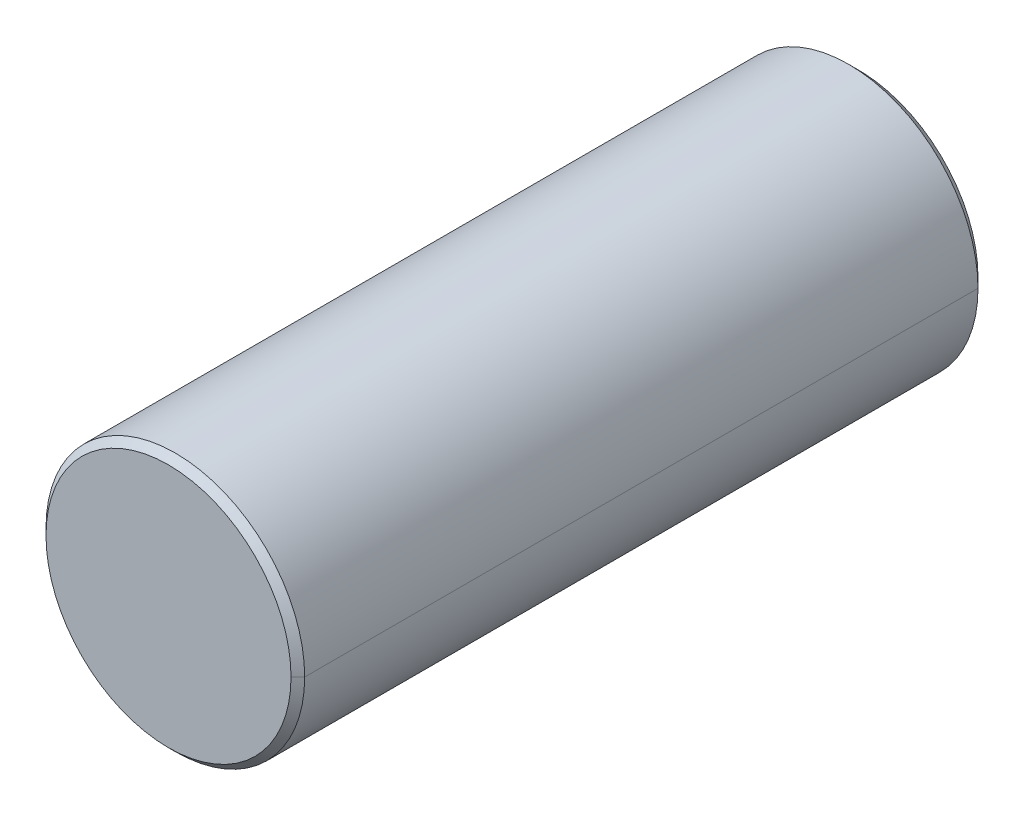
ISO-10303-21;
HEADER;
FILE_DESCRIPTION(('STEP AP214'),'2;1');
FILE_NAME('part.step','',(''),(''),'','','');
FILE_SCHEMA(('AUTOMOTIVE_DESIGN { 1 0 10303 214 1 1 1 1 }'));
ENDSEC;
DATA;
#1=APPLICATION_CONTEXT('core data for automotive mechanical design processes');
#2=APPLICATION_PROTOCOL_DEFINITION('international standard','automotive_design',2000,#1);
#3=PRODUCT_CONTEXT('',#1,'mechanical');
#4=PRODUCT('Part','Part','',(#3));
#5=PRODUCT_RELATED_PRODUCT_CATEGORY('part','',(#4));
#6=PRODUCT_DEFINITION_FORMATION('','',#4);
#7=PRODUCT_DEFINITION_CONTEXT('part definition',#1,'design');
#8=PRODUCT_DEFINITION('design','',#6,#7);
#9=PRODUCT_DEFINITION_SHAPE('','',#8);
#10=(LENGTH_UNIT() NAMED_UNIT(*) SI_UNIT(.MILLI.,.METRE.));
#11=(NAMED_UNIT(*) PLANE_ANGLE_UNIT() SI_UNIT($,.RADIAN.));
#12=(NAMED_UNIT(*) SI_UNIT($,.STERADIAN.) SOLID_ANGLE_UNIT());
#13=UNCERTAINTY_MEASURE_WITH_UNIT(LENGTH_MEASURE(1.E-05),#10,'distance_accuracy_value','');
#14=(GEOMETRIC_REPRESENTATION_CONTEXT(3) GLOBAL_UNCERTAINTY_ASSIGNED_CONTEXT((#13)) GLOBAL_UNIT_ASSIGNED_CONTEXT((#10,
#11,#12)) REPRESENTATION_CONTEXT('',''));
#15=CARTESIAN_POINT('',(0.,0.,0.));
#16=DIRECTION('',(0.,0.,1.));
#17=DIRECTION('',(1.,0.,0.));
#18=AXIS2_PLACEMENT_3D('',#15,#16,#17);
#19=CARTESIAN_POINT('',(0.,0.,-12.3444));
#20=DIRECTION('',(0.,0.,1.));
#21=DIRECTION('',(0.,-1.,0.));
#22=AXIS2_PLACEMENT_3D('',#19,#20,#21);
#23=CONICAL_SURFACE('',#22,4.7625,0.7853981634);
#24=CARTESIAN_POINT('',(0.,0.,-12.7));
#25=DIRECTION('',(0.,0.,-1.));
#26=DIRECTION('',(-1.,0.,0.));
#27=AXIS2_PLACEMENT_3D('',#24,#25,#26);
#28=CIRCLE('',#27,4.4069);
#29=CARTESIAN_POINT('',(-4.4069,0.,-12.7));
#30=VERTEX_POINT('',#29);
#31=CARTESIAN_POINT('',(4.40689999999909,0.,-12.6999999999991));
#32=VERTEX_POINT('',#31);
#33=EDGE_CURVE('E11',#30,#32,#28,.T.);
#34=ORIENTED_EDGE('',*,*,#33,.F.);
#35=DIRECTION('',(-0.707106781188351,0.,0.707106781184744));
#36=VECTOR('',#35,1.);
#37=CARTESIAN_POINT('',(-4.40689999999909,0.,-12.6999999999991));
#38=LINE('',#37,#36);
#39=CARTESIAN_POINT('',(-4.7625,0.,-12.3444));
#40=VERTEX_POINT('',#39);
#41=EDGE_CURVE('E25',#30,#40,#38,.T.);
#42=ORIENTED_EDGE('',*,*,#41,.T.);
#43=CARTESIAN_POINT('',(0.,0.,-12.3444));
#44=DIRECTION('',(0.,0.,-1.));
#45=DIRECTION('',(-1.,0.,0.));
#46=AXIS2_PLACEMENT_3D('',#43,#44,#45);
#47=CIRCLE('',#46,4.7625);
#48=CARTESIAN_POINT('',(4.7625,0.,-12.3444));
#49=VERTEX_POINT('',#48);
#50=EDGE_CURVE('E111',#40,#49,#47,.T.);
#51=ORIENTED_EDGE('',*,*,#50,.T.);
#52=DIRECTION('',(0.707106781188351,0.,0.707106781184744));
#53=VECTOR('',#52,1.);
#54=CARTESIAN_POINT('',(4.40689999999909,0.,-12.6999999999991));
#55=LINE('',#54,#53);
#56=EDGE_CURVE('E106',#32,#49,#55,.T.);
#57=ORIENTED_EDGE('',*,*,#56,.F.);
#58=EDGE_LOOP('',(#34,#42,#51,#57));
#59=FACE_BOUND('',#58,.T.);
#60=ADVANCED_FACE('F17',(#59),#23,.T.);
#61=CARTESIAN_POINT('',(0.,0.,-12.3444));
#62=DIRECTION('',(0.,0.,1.));
#63=DIRECTION('',(0.,1.,0.));
#64=AXIS2_PLACEMENT_3D('',#61,#62,#63);
#65=CONICAL_SURFACE('',#64,4.7625,0.7853981634);
#66=CARTESIAN_POINT('',(0.,0.,-12.3444));
#67=DIRECTION('',(0.,0.,-1.));
#68=DIRECTION('',(-1.,0.,0.));
#69=AXIS2_PLACEMENT_3D('',#66,#67,#68);
#70=CIRCLE('',#69,4.7625);
#71=EDGE_CURVE('E102',#49,#40,#70,.T.);
#72=ORIENTED_EDGE('',*,*,#71,.T.);
#73=ORIENTED_EDGE('',*,*,#41,.F.);
#74=CARTESIAN_POINT('',(0.,0.,-12.7));
#75=DIRECTION('',(0.,0.,-1.));
#76=DIRECTION('',(-1.,0.,0.));
#77=AXIS2_PLACEMENT_3D('',#74,#75,#76);
#78=CIRCLE('',#77,4.4069);
#79=EDGE_CURVE('E97',#32,#30,#78,.T.);
#80=ORIENTED_EDGE('',*,*,#79,.F.);
#81=ORIENTED_EDGE('',*,*,#56,.T.);
#82=EDGE_LOOP('',(#72,#73,#80,#81));
#83=FACE_BOUND('',#82,.T.);
#84=ADVANCED_FACE('F125',(#83),#65,.T.);
#85=CARTESIAN_POINT('',(0.,4.4069,-12.7));
#86=DIRECTION('',(0.,0.,1.));
#87=DIRECTION('',(1.,0.,0.));
#88=AXIS2_PLACEMENT_3D('',#85,#86,#87);
#89=PLANE('',#88);
#90=ORIENTED_EDGE('',*,*,#33,.T.);
#91=ORIENTED_EDGE('',*,*,#79,.T.);
#92=EDGE_LOOP('',(#90,#91));
#93=FACE_BOUND('',#92,.T.);
#94=ADVANCED_FACE('F138',(#93),#89,.F.);
#95=CARTESIAN_POINT('',(0.,0.,-12.7));
#96=DIRECTION('',(0.,0.,1.));
#97=DIRECTION('',(0.,1.,0.));
#98=AXIS2_PLACEMENT_3D('',#95,#96,#97);
#99=CYLINDRICAL_SURFACE('',#98,4.7625);
#100=CARTESIAN_POINT('',(0.,0.,12.44855282861));
#101=DIRECTION('',(0.,0.,-1.));
#102=DIRECTION('',(-1.,0.,0.));
#103=AXIS2_PLACEMENT_3D('',#100,#101,#102);
#104=CIRCLE('',#103,4.7625);
#105=CARTESIAN_POINT('',(4.7625,0.,12.44855282861));
#106=VERTEX_POINT('',#105);
#107=CARTESIAN_POINT('',(-4.7625,0.,12.44855282861));
#108=VERTEX_POINT('',#107);
#109=EDGE_CURVE('E68',#106,#108,#104,.T.);
#110=ORIENTED_EDGE('',*,*,#109,.T.);
#111=DIRECTION('',(0.,0.,1.));
#112=VECTOR('',#111,1.);
#113=CARTESIAN_POINT('',(-4.7625,0.,-12.3444));
#114=LINE('',#113,#112);
#115=EDGE_CURVE('E89',#40,#108,#114,.T.);
#116=ORIENTED_EDGE('',*,*,#115,.F.);
#117=ORIENTED_EDGE('',*,*,#71,.F.);
#118=DIRECTION('',(0.,0.,1.));
#119=VECTOR('',#118,1.);
#120=CARTESIAN_POINT('',(4.7625,0.,-12.3444));
#121=LINE('',#120,#119);
#122=EDGE_CURVE('E85',#49,#106,#121,.T.);
#123=ORIENTED_EDGE('',*,*,#122,.T.);
#124=EDGE_LOOP('',(#110,#116,#117,#123));
#125=FACE_BOUND('',#124,.T.);
#126=ADVANCED_FACE('F128',(#125),#99,.T.);
#127=CARTESIAN_POINT('',(0.,0.,-12.7));
#128=DIRECTION('',(0.,0.,1.));
#129=DIRECTION('',(0.,-1.,0.));
#130=AXIS2_PLACEMENT_3D('',#127,#128,#129);
#131=CYLINDRICAL_SURFACE('',#130,4.7625);
#132=ORIENTED_EDGE('',*,*,#50,.F.);
#133=ORIENTED_EDGE('',*,*,#115,.T.);
#134=CARTESIAN_POINT('',(0.,0.,12.44855282861));
#135=DIRECTION('',(0.,0.,-1.));
#136=DIRECTION('',(-1.,0.,0.));
#137=AXIS2_PLACEMENT_3D('',#134,#135,#136);
#138=CIRCLE('',#137,4.7625);
#139=EDGE_CURVE('E80',#108,#106,#138,.T.);
#140=ORIENTED_EDGE('',*,*,#139,.T.);
#141=ORIENTED_EDGE('',*,*,#122,.F.);
#142=EDGE_LOOP('',(#132,#133,#140,#141));
#143=FACE_BOUND('',#142,.T.);
#144=ADVANCED_FACE('F129',(#143),#131,.T.);
#145=CARTESIAN_POINT('',(0.,0.,12.7));
#146=DIRECTION('',(0.,0.,-1.));
#147=DIRECTION('',(0.,-1.,0.));
#148=AXIS2_PLACEMENT_3D('',#145,#146,#147);
#149=CONICAL_SURFACE('',#148,4.51105282954,0.7853981634);
#150=ORIENTED_EDGE('',*,*,#139,.F.);
#151=DIRECTION('',(-0.707106781188356,0.,-0.707106781184739));
#152=VECTOR('',#151,1.);
#153=CARTESIAN_POINT('',(-4.51105282954,0.,12.7));
#154=LINE('',#153,#152);
#155=CARTESIAN_POINT('',(-4.51105282861011,0.,12.7));
#156=VERTEX_POINT('',#155);
#157=EDGE_CURVE('E60',#156,#108,#154,.T.);
#158=ORIENTED_EDGE('',*,*,#157,.F.);
#159=CARTESIAN_POINT('',(0.,0.,12.7));
#160=DIRECTION('',(0.,0.,-1.));
#161=DIRECTION('',(-1.,0.,0.));
#162=AXIS2_PLACEMENT_3D('',#159,#160,#161);
#163=CIRCLE('',#162,4.51105282954);
#164=CARTESIAN_POINT('',(4.51105282954,0.,12.7));
#165=VERTEX_POINT('',#164);
#166=EDGE_CURVE('E53',#156,#165,#163,.T.);
#167=ORIENTED_EDGE('',*,*,#166,.T.);
#168=DIRECTION('',(0.707106781188356,0.,-0.707106781184739));
#169=VECTOR('',#168,1.);
#170=CARTESIAN_POINT('',(4.51105282954,0.,12.7));
#171=LINE('',#170,#169);
#172=EDGE_CURVE('E57',#165,#106,#171,.T.);
#173=ORIENTED_EDGE('',*,*,#172,.T.);
#174=EDGE_LOOP('',(#150,#158,#167,#173));
#175=FACE_BOUND('',#174,.T.);
#176=ADVANCED_FACE('F56',(#175),#149,.T.);
#177=CARTESIAN_POINT('',(0.,0.,12.7));
#178=DIRECTION('',(0.,0.,-1.));
#179=DIRECTION('',(0.,1.,0.));
#180=AXIS2_PLACEMENT_3D('',#177,#178,#179);
#181=CONICAL_SURFACE('',#180,4.51105282954,0.7853981634);
#182=CARTESIAN_POINT('',(0.,0.,12.7));
#183=DIRECTION('',(0.,0.,-1.));
#184=DIRECTION('',(-1.,0.,0.));
#185=AXIS2_PLACEMENT_3D('',#182,#183,#184);
#186=CIRCLE('',#185,4.51105282954);
#187=EDGE_CURVE('E67',#165,#156,#186,.T.);
#188=ORIENTED_EDGE('',*,*,#187,.T.);
#189=ORIENTED_EDGE('',*,*,#157,.T.);
#190=ORIENTED_EDGE('',*,*,#109,.F.);
#191=ORIENTED_EDGE('',*,*,#172,.F.);
#192=EDGE_LOOP('',(#188,#189,#190,#191));
#193=FACE_BOUND('',#192,.T.);
#194=ADVANCED_FACE('F66',(#193),#181,.T.);
#195=CARTESIAN_POINT('',(0.,0.,12.7));
#196=DIRECTION('',(0.,0.,-1.));
#197=DIRECTION('',(-1.,0.,0.));
#198=AXIS2_PLACEMENT_3D('',#195,#196,#197);
#199=PLANE('',#198);
#200=ORIENTED_EDGE('',*,*,#166,.F.);
#201=ORIENTED_EDGE('',*,*,#187,.F.);
#202=EDGE_LOOP('',(#200,#201));
#203=FACE_BOUND('',#202,.T.);
#204=ADVANCED_FACE('F70',(#203),#199,.F.);
#205=CLOSED_SHELL('',(#60,#84,#94,#126,#144,#176,#194,#204));
#206=MANIFOLD_SOLID_BREP('B1',#205);
#207=ADVANCED_BREP_SHAPE_REPRESENTATION('',(#18,#206),#14);
#208=SHAPE_DEFINITION_REPRESENTATION(#9,#207);
ENDSEC;
END-ISO-10303-21;
